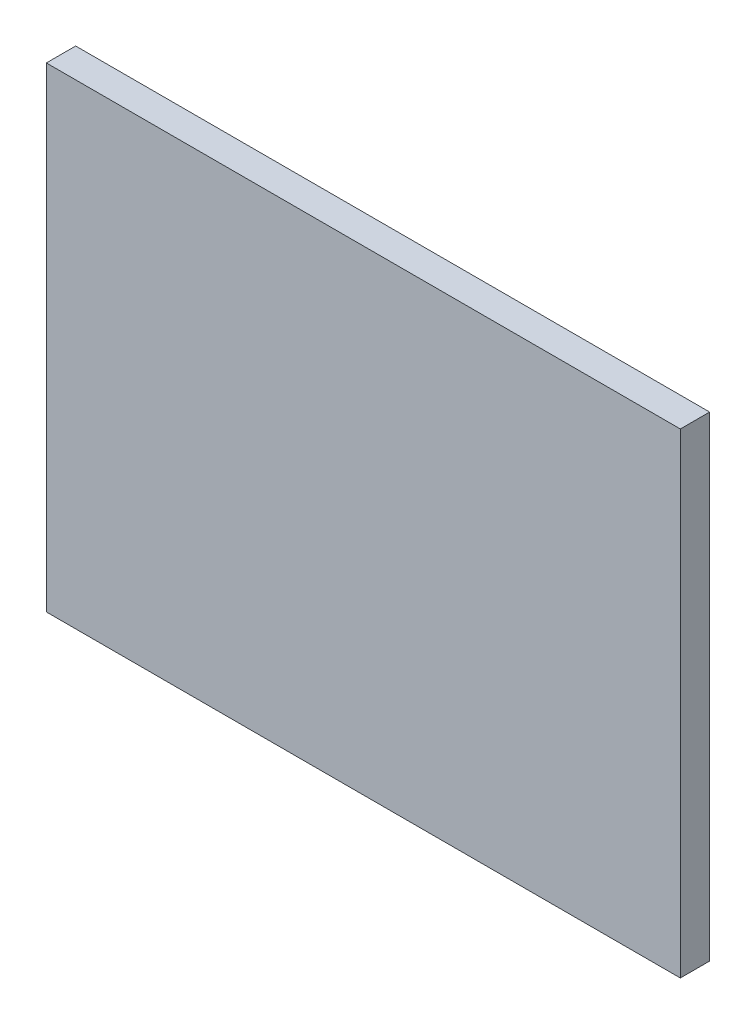
ISO-10303-21;
HEADER;
FILE_DESCRIPTION(('STEP AP214'),'2;1');
FILE_NAME('part.step','',(''),(''),'','','');
FILE_SCHEMA(('AUTOMOTIVE_DESIGN { 1 0 10303 214 1 1 1 1 }'));
ENDSEC;
DATA;
#1=APPLICATION_CONTEXT('core data for automotive mechanical design processes');
#2=APPLICATION_PROTOCOL_DEFINITION('international standard','automotive_design',2000,#1);
#3=PRODUCT_CONTEXT('',#1,'mechanical');
#4=PRODUCT('Part','Part','',(#3));
#5=PRODUCT_RELATED_PRODUCT_CATEGORY('part','',(#4));
#6=PRODUCT_DEFINITION_FORMATION('','',#4);
#7=PRODUCT_DEFINITION_CONTEXT('part definition',#1,'design');
#8=PRODUCT_DEFINITION('design','',#6,#7);
#9=PRODUCT_DEFINITION_SHAPE('','',#8);
#10=(LENGTH_UNIT() NAMED_UNIT(*) SI_UNIT(.MILLI.,.METRE.));
#11=(NAMED_UNIT(*) PLANE_ANGLE_UNIT() SI_UNIT($,.RADIAN.));
#12=(NAMED_UNIT(*) SI_UNIT($,.STERADIAN.) SOLID_ANGLE_UNIT());
#13=UNCERTAINTY_MEASURE_WITH_UNIT(LENGTH_MEASURE(1.E-05),#10,'distance_accuracy_value','');
#14=(GEOMETRIC_REPRESENTATION_CONTEXT(3) GLOBAL_UNCERTAINTY_ASSIGNED_CONTEXT((#13)) GLOBAL_UNIT_ASSIGNED_CONTEXT((#10,
#11,#12)) REPRESENTATION_CONTEXT('',''));
#15=CARTESIAN_POINT('',(0.,0.,0.));
#16=DIRECTION('',(0.,0.,1.));
#17=DIRECTION('',(1.,0.,0.));
#18=AXIS2_PLACEMENT_3D('',#15,#16,#17);
#19=CARTESIAN_POINT('',(0.,0.,9.398));
#20=DIRECTION('',(1.,0.,0.));
#21=DIRECTION('',(0.,0.,-1.));
#22=AXIS2_PLACEMENT_3D('',#19,#20,#21);
#23=PLANE('',#22);
#24=DIRECTION('',(0.,-1.,0.));
#25=VECTOR('',#24,1.);
#26=CARTESIAN_POINT('',(0.,0.,0.));
#27=LINE('',#26,#25);
#28=CARTESIAN_POINT('',(0.,152.4,0.));
#29=VERTEX_POINT('',#28);
#30=CARTESIAN_POINT('',(0.,0.,0.));
#31=VERTEX_POINT('',#30);
#32=EDGE_CURVE('E96',#29,#31,#27,.T.);
#33=ORIENTED_EDGE('',*,*,#32,.T.);
#34=DIRECTION('',(0.,0.,-1.));
#35=VECTOR('',#34,1.);
#36=CARTESIAN_POINT('',(0.,0.,9.398));
#37=LINE('',#36,#35);
#38=CARTESIAN_POINT('',(0.,0.,9.398));
#39=VERTEX_POINT('',#38);
#40=EDGE_CURVE('E11',#39,#31,#37,.T.);
#41=ORIENTED_EDGE('',*,*,#40,.F.);
#42=DIRECTION('',(0.,-1.,0.));
#43=VECTOR('',#42,1.);
#44=CARTESIAN_POINT('',(0.,0.,9.398));
#45=LINE('',#44,#43);
#46=CARTESIAN_POINT('',(0.,152.4,9.398));
#47=VERTEX_POINT('',#46);
#48=EDGE_CURVE('E84',#47,#39,#45,.T.);
#49=ORIENTED_EDGE('',*,*,#48,.F.);
#50=DIRECTION('',(0.,0.,-1.));
#51=VECTOR('',#50,1.);
#52=CARTESIAN_POINT('',(0.,152.4,9.398));
#53=LINE('',#52,#51);
#54=EDGE_CURVE('E92',#47,#29,#53,.T.);
#55=ORIENTED_EDGE('',*,*,#54,.T.);
#56=EDGE_LOOP('',(#33,#41,#49,#55));
#57=FACE_BOUND('',#56,.T.);
#58=ADVANCED_FACE('F33',(#57),#23,.F.);
#59=CARTESIAN_POINT('',(0.,0.,9.398));
#60=DIRECTION('',(0.,1.,0.));
#61=DIRECTION('',(0.,0.,1.));
#62=AXIS2_PLACEMENT_3D('',#59,#60,#61);
#63=PLANE('',#62);
#64=DIRECTION('',(1.,0.,0.));
#65=VECTOR('',#64,1.);
#66=CARTESIAN_POINT('',(0.,0.,0.));
#67=LINE('',#66,#65);
#68=CARTESIAN_POINT('',(203.2,0.,0.));
#69=VERTEX_POINT('',#68);
#70=EDGE_CURVE('E88',#31,#69,#67,.T.);
#71=ORIENTED_EDGE('',*,*,#70,.T.);
#72=DIRECTION('',(0.,0.,-1.));
#73=VECTOR('',#72,1.);
#74=CARTESIAN_POINT('',(203.2,0.,9.398));
#75=LINE('',#74,#73);
#76=CARTESIAN_POINT('',(203.2,0.,9.398));
#77=VERTEX_POINT('',#76);
#78=EDGE_CURVE('E41',#77,#69,#75,.T.);
#79=ORIENTED_EDGE('',*,*,#78,.F.);
#80=DIRECTION('',(1.,0.,0.));
#81=VECTOR('',#80,1.);
#82=CARTESIAN_POINT('',(0.,0.,9.398));
#83=LINE('',#82,#81);
#84=EDGE_CURVE('E79',#39,#77,#83,.T.);
#85=ORIENTED_EDGE('',*,*,#84,.F.);
#86=ORIENTED_EDGE('',*,*,#40,.T.);
#87=EDGE_LOOP('',(#71,#79,#85,#86));
#88=FACE_BOUND('',#87,.T.);
#89=ADVANCED_FACE('F87',(#88),#63,.F.);
#90=CARTESIAN_POINT('',(203.2,0.,9.398));
#91=DIRECTION('',(-1.,0.,0.));
#92=DIRECTION('',(0.,-1.,0.));
#93=AXIS2_PLACEMENT_3D('',#90,#91,#92);
#94=PLANE('',#93);
#95=DIRECTION('',(0.,1.,0.));
#96=VECTOR('',#95,1.);
#97=CARTESIAN_POINT('',(203.2,0.,0.));
#98=LINE('',#97,#96);
#99=CARTESIAN_POINT('',(203.2,152.4,0.));
#100=VERTEX_POINT('',#99);
#101=EDGE_CURVE('E66',#69,#100,#98,.T.);
#102=ORIENTED_EDGE('',*,*,#101,.T.);
#103=DIRECTION('',(0.,0.,-1.));
#104=VECTOR('',#103,1.);
#105=CARTESIAN_POINT('',(203.2,152.4,9.398));
#106=LINE('',#105,#104);
#107=CARTESIAN_POINT('',(203.2,152.4,9.398));
#108=VERTEX_POINT('',#107);
#109=EDGE_CURVE('E89',#108,#100,#106,.T.);
#110=ORIENTED_EDGE('',*,*,#109,.F.);
#111=DIRECTION('',(0.,1.,0.));
#112=VECTOR('',#111,1.);
#113=CARTESIAN_POINT('',(203.2,0.,9.398));
#114=LINE('',#113,#112);
#115=EDGE_CURVE('E82',#77,#108,#114,.T.);
#116=ORIENTED_EDGE('',*,*,#115,.F.);
#117=ORIENTED_EDGE('',*,*,#78,.T.);
#118=EDGE_LOOP('',(#102,#110,#116,#117));
#119=FACE_BOUND('',#118,.T.);
#120=ADVANCED_FACE('F90',(#119),#94,.F.);
#121=CARTESIAN_POINT('',(0.,152.4,9.398));
#122=DIRECTION('',(0.,-1.,0.));
#123=DIRECTION('',(0.,0.,-1.));
#124=AXIS2_PLACEMENT_3D('',#121,#122,#123);
#125=PLANE('',#124);
#126=DIRECTION('',(-1.,0.,0.));
#127=VECTOR('',#126,1.);
#128=CARTESIAN_POINT('',(0.,152.4,0.));
#129=LINE('',#128,#127);
#130=EDGE_CURVE('E72',#100,#29,#129,.T.);
#131=ORIENTED_EDGE('',*,*,#130,.T.);
#132=ORIENTED_EDGE('',*,*,#54,.F.);
#133=DIRECTION('',(-1.,0.,0.));
#134=VECTOR('',#133,1.);
#135=CARTESIAN_POINT('',(0.,152.4,9.398));
#136=LINE('',#135,#134);
#137=EDGE_CURVE('E49',#108,#47,#136,.T.);
#138=ORIENTED_EDGE('',*,*,#137,.F.);
#139=ORIENTED_EDGE('',*,*,#109,.T.);
#140=EDGE_LOOP('',(#131,#132,#138,#139));
#141=FACE_BOUND('',#140,.T.);
#142=ADVANCED_FACE('F103',(#141),#125,.F.);
#143=CARTESIAN_POINT('',(0.,0.,9.398));
#144=DIRECTION('',(0.,0.,-1.));
#145=DIRECTION('',(-1.,0.,0.));
#146=AXIS2_PLACEMENT_3D('',#143,#144,#145);
#147=PLANE('',#146);
#148=ORIENTED_EDGE('',*,*,#48,.T.);
#149=ORIENTED_EDGE('',*,*,#84,.T.);
#150=ORIENTED_EDGE('',*,*,#115,.T.);
#151=ORIENTED_EDGE('',*,*,#137,.T.);
#152=EDGE_LOOP('',(#148,#149,#150,#151));
#153=FACE_BOUND('',#152,.T.);
#154=ADVANCED_FACE('F80',(#153),#147,.F.);
#155=CARTESIAN_POINT('',(0.,0.,0.));
#156=DIRECTION('',(0.,0.,-1.));
#157=DIRECTION('',(-1.,0.,0.));
#158=AXIS2_PLACEMENT_3D('',#155,#156,#157);
#159=PLANE('',#158);
#160=ORIENTED_EDGE('',*,*,#32,.F.);
#161=ORIENTED_EDGE('',*,*,#130,.F.);
#162=ORIENTED_EDGE('',*,*,#101,.F.);
#163=ORIENTED_EDGE('',*,*,#70,.F.);
#164=EDGE_LOOP('',(#160,#161,#162,#163));
#165=FACE_BOUND('',#164,.T.);
#166=ADVANCED_FACE('F106',(#165),#159,.T.);
#167=CLOSED_SHELL('',(#58,#89,#120,#142,#154,#166));
#168=MANIFOLD_SOLID_BREP('B2',#167);
#169=ADVANCED_BREP_SHAPE_REPRESENTATION('',(#18,#168),#14);
#170=SHAPE_DEFINITION_REPRESENTATION(#9,#169);
ENDSEC;
END-ISO-10303-21;
